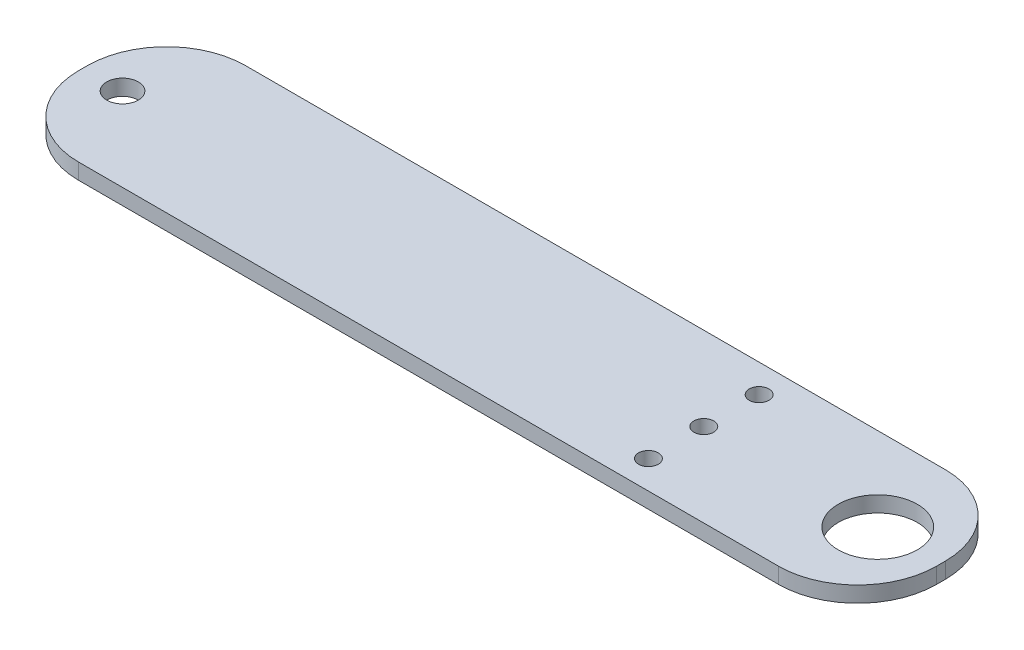
ISO-10303-21;
HEADER;
FILE_DESCRIPTION(('STEP AP214'),'2;1');
FILE_NAME('part.step','',(''),(''),'','','');
FILE_SCHEMA(('AUTOMOTIVE_DESIGN { 1 0 10303 214 1 1 1 1 }'));
ENDSEC;
DATA;
#1=APPLICATION_CONTEXT('core data for automotive mechanical design processes');
#2=APPLICATION_PROTOCOL_DEFINITION('international standard','automotive_design',2000,#1);
#3=PRODUCT_CONTEXT('',#1,'mechanical');
#4=PRODUCT('Part','Part','',(#3));
#5=PRODUCT_RELATED_PRODUCT_CATEGORY('part','',(#4));
#6=PRODUCT_DEFINITION_FORMATION('','',#4);
#7=PRODUCT_DEFINITION_CONTEXT('part definition',#1,'design');
#8=PRODUCT_DEFINITION('design','',#6,#7);
#9=PRODUCT_DEFINITION_SHAPE('','',#8);
#10=(LENGTH_UNIT() NAMED_UNIT(*) SI_UNIT(.MILLI.,.METRE.));
#11=(NAMED_UNIT(*) PLANE_ANGLE_UNIT() SI_UNIT($,.RADIAN.));
#12=(NAMED_UNIT(*) SI_UNIT($,.STERADIAN.) SOLID_ANGLE_UNIT());
#13=UNCERTAINTY_MEASURE_WITH_UNIT(LENGTH_MEASURE(1.E-05),#10,'distance_accuracy_value','');
#14=(GEOMETRIC_REPRESENTATION_CONTEXT(3) GLOBAL_UNCERTAINTY_ASSIGNED_CONTEXT((#13)) GLOBAL_UNIT_ASSIGNED_CONTEXT((#10,
#11,#12)) REPRESENTATION_CONTEXT('',''));
#15=CARTESIAN_POINT('',(0.,0.,0.));
#16=DIRECTION('',(0.,0.,1.));
#17=DIRECTION('',(1.,0.,0.));
#18=AXIS2_PLACEMENT_3D('',#15,#16,#17);
#19=CARTESIAN_POINT('',(-38.5,2.,0.));
#20=DIRECTION('',(-1.,0.,0.));
#21=DIRECTION('',(0.,0.,1.));
#22=AXIS2_PLACEMENT_3D('',#19,#20,#21);
#23=PLANE('',#22);
#24=DIRECTION('',(0.,0.,-1.));
#25=VECTOR('',#24,1.);
#26=CARTESIAN_POINT('',(-38.5,2.,0.));
#27=LINE('',#26,#25);
#28=CARTESIAN_POINT('',(-38.5,2.,0.558375634517767));
#29=VERTEX_POINT('',#28);
#30=CARTESIAN_POINT('',(-38.5,2.,-0.558375634517767));
#31=VERTEX_POINT('',#30);
#32=EDGE_CURVE('E159',#29,#31,#27,.T.);
#33=ORIENTED_EDGE('',*,*,#32,.T.);
#34=DIRECTION('',(0.,-1.,0.));
#35=VECTOR('',#34,1.);
#36=CARTESIAN_POINT('',(-38.5,2.,-0.558375634517767));
#37=LINE('',#36,#35);
#38=CARTESIAN_POINT('',(-38.5,0.,-0.558375634517767));
#39=VERTEX_POINT('',#38);
#40=EDGE_CURVE('E120',#31,#39,#37,.T.);
#41=ORIENTED_EDGE('',*,*,#40,.T.);
#42=DIRECTION('',(0.,0.,-1.));
#43=VECTOR('',#42,1.);
#44=CARTESIAN_POINT('',(-38.5,0.,0.));
#45=LINE('',#44,#43);
#46=CARTESIAN_POINT('',(-38.5,0.,0.558375634517767));
#47=VERTEX_POINT('',#46);
#48=EDGE_CURVE('E104',#47,#39,#45,.T.);
#49=ORIENTED_EDGE('',*,*,#48,.F.);
#50=DIRECTION('',(0.,-1.,0.));
#51=VECTOR('',#50,1.);
#52=CARTESIAN_POINT('',(-38.5,2.,0.558375634517767));
#53=LINE('',#52,#51);
#54=EDGE_CURVE('E117',#47,#29,#53,.F.);
#55=ORIENTED_EDGE('',*,*,#54,.T.);
#56=EDGE_LOOP('',(#33,#41,#49,#55));
#57=FACE_BOUND('',#56,.T.);
#58=ADVANCED_FACE('F35',(#57),#23,.T.);
#59=CARTESIAN_POINT('',(0.,2.,10.5583756345178));
#60=DIRECTION('',(0.,0.,-1.));
#61=DIRECTION('',(-1.,0.,0.));
#62=AXIS2_PLACEMENT_3D('',#59,#60,#61);
#63=PLANE('',#62);
#64=DIRECTION('',(1.,0.,0.));
#65=VECTOR('',#64,1.);
#66=CARTESIAN_POINT('',(0.,2.,10.5583756345178));
#67=LINE('',#66,#65);
#68=CARTESIAN_POINT('',(-28.5,2.,10.5583756345178));
#69=VERTEX_POINT('',#68);
#70=CARTESIAN_POINT('',(60.,2.,10.5583756345178));
#71=VERTEX_POINT('',#70);
#72=EDGE_CURVE('E158',#69,#71,#67,.T.);
#73=ORIENTED_EDGE('',*,*,#72,.F.);
#74=DIRECTION('',(0.,-1.,0.));
#75=VECTOR('',#74,1.);
#76=CARTESIAN_POINT('',(-28.5,0.,10.5583756345178));
#77=LINE('',#76,#75);
#78=CARTESIAN_POINT('',(-28.5,0.,10.5583756345178));
#79=VERTEX_POINT('',#78);
#80=EDGE_CURVE('E153',#69,#79,#77,.T.);
#81=ORIENTED_EDGE('',*,*,#80,.T.);
#82=DIRECTION('',(1.,0.,0.));
#83=VECTOR('',#82,1.);
#84=CARTESIAN_POINT('',(0.,0.,10.5583756345178));
#85=LINE('',#84,#83);
#86=CARTESIAN_POINT('',(60.,0.,10.5583756345178));
#87=VERTEX_POINT('',#86);
#88=EDGE_CURVE('E106',#79,#87,#85,.T.);
#89=ORIENTED_EDGE('',*,*,#88,.T.);
#90=DIRECTION('',(0.,-1.,0.));
#91=VECTOR('',#90,1.);
#92=CARTESIAN_POINT('',(60.,2.,10.5583756345178));
#93=LINE('',#92,#91);
#94=EDGE_CURVE('E151',#87,#71,#93,.F.);
#95=ORIENTED_EDGE('',*,*,#94,.T.);
#96=EDGE_LOOP('',(#73,#81,#89,#95));
#97=FACE_BOUND('',#96,.T.);
#98=ADVANCED_FACE('F156',(#97),#63,.F.);
#99=CARTESIAN_POINT('',(70.,2.,0.));
#100=DIRECTION('',(1.,0.,0.));
#101=DIRECTION('',(0.,0.,-1.));
#102=AXIS2_PLACEMENT_3D('',#99,#100,#101);
#103=PLANE('',#102);
#104=DIRECTION('',(0.,0.,1.));
#105=VECTOR('',#104,1.);
#106=CARTESIAN_POINT('',(70.,2.,0.));
#107=LINE('',#106,#105);
#108=CARTESIAN_POINT('',(70.,2.,-0.55837563451777));
#109=VERTEX_POINT('',#108);
#110=CARTESIAN_POINT('',(70.,2.,0.55837563451777));
#111=VERTEX_POINT('',#110);
#112=EDGE_CURVE('E131',#109,#111,#107,.T.);
#113=ORIENTED_EDGE('',*,*,#112,.T.);
#114=DIRECTION('',(0.,-1.,0.));
#115=VECTOR('',#114,1.);
#116=CARTESIAN_POINT('',(70.,0.,0.55837563451777));
#117=LINE('',#116,#115);
#118=CARTESIAN_POINT('',(70.,0.,0.55837563451777));
#119=VERTEX_POINT('',#118);
#120=EDGE_CURVE('E11',#111,#119,#117,.T.);
#121=ORIENTED_EDGE('',*,*,#120,.T.);
#122=DIRECTION('',(0.,0.,1.));
#123=VECTOR('',#122,1.);
#124=CARTESIAN_POINT('',(70.,0.,0.));
#125=LINE('',#124,#123);
#126=CARTESIAN_POINT('',(70.,0.,-0.55837563451777));
#127=VERTEX_POINT('',#126);
#128=EDGE_CURVE('E180',#127,#119,#125,.T.);
#129=ORIENTED_EDGE('',*,*,#128,.F.);
#130=DIRECTION('',(0.,-1.,0.));
#131=VECTOR('',#130,1.);
#132=CARTESIAN_POINT('',(70.,2.,-0.55837563451777));
#133=LINE('',#132,#131);
#134=EDGE_CURVE('E43',#127,#109,#133,.F.);
#135=ORIENTED_EDGE('',*,*,#134,.T.);
#136=EDGE_LOOP('',(#113,#121,#129,#135));
#137=FACE_BOUND('',#136,.T.);
#138=ADVANCED_FACE('F218',(#137),#103,.T.);
#139=CARTESIAN_POINT('',(62.,2.,0.));
#140=DIRECTION('',(0.,-1.,0.));
#141=DIRECTION('',(0.,0.,-1.));
#142=AXIS2_PLACEMENT_3D('',#139,#140,#141);
#143=CYLINDRICAL_SURFACE('',#142,5.);
#144=CARTESIAN_POINT('',(62.,2.,0.));
#145=DIRECTION('',(0.,1.,0.));
#146=DIRECTION('',(0.,0.,1.));
#147=AXIS2_PLACEMENT_3D('',#144,#145,#146);
#148=CIRCLE('',#147,5.);
#149=CARTESIAN_POINT('',(62.,2.,4.99999999999998));
#150=VERTEX_POINT('',#149);
#151=EDGE_CURVE('E162',#150,#150,#148,.T.);
#152=ORIENTED_EDGE('',*,*,#151,.T.);
#153=EDGE_LOOP('',(#152));
#154=FACE_BOUND('',#153,.T.);
#155=CARTESIAN_POINT('',(62.,0.,0.));
#156=DIRECTION('',(0.,1.,0.));
#157=DIRECTION('',(0.,0.,1.));
#158=AXIS2_PLACEMENT_3D('',#155,#156,#157);
#159=CIRCLE('',#158,5.);
#160=CARTESIAN_POINT('',(62.,0.,4.99999999999998));
#161=VERTEX_POINT('',#160);
#162=EDGE_CURVE('E121',#161,#161,#159,.T.);
#163=ORIENTED_EDGE('',*,*,#162,.F.);
#164=EDGE_LOOP('',(#163));
#165=FACE_BOUND('',#164,.T.);
#166=ADVANCED_FACE('F201',(#154,#165),#143,.F.);
#167=CARTESIAN_POINT('',(-33.5000000000009,2.,-1.31838984174237E-13));
#168=DIRECTION('',(0.,-1.,0.));
#169=DIRECTION('',(0.,0.,-1.));
#170=AXIS2_PLACEMENT_3D('',#167,#168,#169);
#171=CYLINDRICAL_SURFACE('',#170,2.00000000000091);
#172=CARTESIAN_POINT('',(-33.5000000000009,2.,-1.31838984174237E-13));
#173=DIRECTION('',(0.,1.,0.));
#174=DIRECTION('',(0.,0.,1.));
#175=AXIS2_PLACEMENT_3D('',#172,#173,#174);
#176=CIRCLE('',#175,2.00000000000091);
#177=CARTESIAN_POINT('',(-33.5000000000009,2.,2.00000000000078));
#178=VERTEX_POINT('',#177);
#179=EDGE_CURVE('E196',#178,#178,#176,.T.);
#180=ORIENTED_EDGE('',*,*,#179,.T.);
#181=EDGE_LOOP('',(#180));
#182=FACE_BOUND('',#181,.T.);
#183=CARTESIAN_POINT('',(-33.5000000000009,0.,-1.31838984174237E-13));
#184=DIRECTION('',(0.,1.,0.));
#185=DIRECTION('',(0.,0.,1.));
#186=AXIS2_PLACEMENT_3D('',#183,#184,#185);
#187=CIRCLE('',#186,2.00000000000091);
#188=CARTESIAN_POINT('',(-33.5000000000009,0.,2.00000000000078));
#189=VERTEX_POINT('',#188);
#190=EDGE_CURVE('E175',#189,#189,#187,.T.);
#191=ORIENTED_EDGE('',*,*,#190,.F.);
#192=EDGE_LOOP('',(#191));
#193=FACE_BOUND('',#192,.T.);
#194=ADVANCED_FACE('F238',(#182,#193),#171,.F.);
#195=CARTESIAN_POINT('',(40.,2.,0.));
#196=DIRECTION('',(0.,-1.,0.));
#197=DIRECTION('',(0.,0.,-1.));
#198=AXIS2_PLACEMENT_3D('',#195,#196,#197);
#199=CYLINDRICAL_SURFACE('',#198,1.25);
#200=CARTESIAN_POINT('',(40.,2.,0.));
#201=DIRECTION('',(0.,1.,0.));
#202=DIRECTION('',(0.,0.,1.));
#203=AXIS2_PLACEMENT_3D('',#200,#201,#202);
#204=CIRCLE('',#203,1.25);
#205=CARTESIAN_POINT('',(40.,2.,1.24999999999999));
#206=VERTEX_POINT('',#205);
#207=EDGE_CURVE('E191',#206,#206,#204,.T.);
#208=ORIENTED_EDGE('',*,*,#207,.T.);
#209=EDGE_LOOP('',(#208));
#210=FACE_BOUND('',#209,.T.);
#211=CARTESIAN_POINT('',(40.,0.,0.));
#212=DIRECTION('',(0.,1.,0.));
#213=DIRECTION('',(0.,0.,1.));
#214=AXIS2_PLACEMENT_3D('',#211,#212,#213);
#215=CIRCLE('',#214,1.25);
#216=CARTESIAN_POINT('',(40.,0.,1.24999999999999));
#217=VERTEX_POINT('',#216);
#218=EDGE_CURVE('E172',#217,#217,#215,.T.);
#219=ORIENTED_EDGE('',*,*,#218,.F.);
#220=EDGE_LOOP('',(#219));
#221=FACE_BOUND('',#220,.T.);
#222=ADVANCED_FACE('F241',(#210,#221),#199,.F.);
#223=CARTESIAN_POINT('',(40.,2.,-7.00000000000001));
#224=DIRECTION('',(0.,-1.,0.));
#225=DIRECTION('',(0.,0.,-1.));
#226=AXIS2_PLACEMENT_3D('',#223,#224,#225);
#227=CYLINDRICAL_SURFACE('',#226,1.25);
#228=CARTESIAN_POINT('',(40.,2.,-7.00000000000001));
#229=DIRECTION('',(0.,1.,0.));
#230=DIRECTION('',(0.,0.,1.));
#231=AXIS2_PLACEMENT_3D('',#228,#229,#230);
#232=CIRCLE('',#231,1.25);
#233=CARTESIAN_POINT('',(40.,2.,-5.75000000000001));
#234=VERTEX_POINT('',#233);
#235=EDGE_CURVE('E186',#234,#234,#232,.T.);
#236=ORIENTED_EDGE('',*,*,#235,.T.);
#237=EDGE_LOOP('',(#236));
#238=FACE_BOUND('',#237,.T.);
#239=CARTESIAN_POINT('',(40.,0.,-7.00000000000001));
#240=DIRECTION('',(0.,1.,0.));
#241=DIRECTION('',(0.,0.,1.));
#242=AXIS2_PLACEMENT_3D('',#239,#240,#241);
#243=CIRCLE('',#242,1.25);
#244=CARTESIAN_POINT('',(40.,0.,-5.75000000000001));
#245=VERTEX_POINT('',#244);
#246=EDGE_CURVE('E169',#245,#245,#243,.T.);
#247=ORIENTED_EDGE('',*,*,#246,.F.);
#248=EDGE_LOOP('',(#247));
#249=FACE_BOUND('',#248,.T.);
#250=ADVANCED_FACE('F245',(#238,#249),#227,.F.);
#251=CARTESIAN_POINT('',(40.,2.,6.99999999999999));
#252=DIRECTION('',(0.,-1.,0.));
#253=DIRECTION('',(0.,0.,-1.));
#254=AXIS2_PLACEMENT_3D('',#251,#252,#253);
#255=CYLINDRICAL_SURFACE('',#254,1.25);
#256=CARTESIAN_POINT('',(40.,2.,6.99999999999999));
#257=DIRECTION('',(0.,1.,0.));
#258=DIRECTION('',(0.,0.,1.));
#259=AXIS2_PLACEMENT_3D('',#256,#257,#258);
#260=CIRCLE('',#259,1.25);
#261=CARTESIAN_POINT('',(40.,2.,8.24999999999999));
#262=VERTEX_POINT('',#261);
#263=EDGE_CURVE('E183',#262,#262,#260,.T.);
#264=ORIENTED_EDGE('',*,*,#263,.T.);
#265=EDGE_LOOP('',(#264));
#266=FACE_BOUND('',#265,.T.);
#267=CARTESIAN_POINT('',(40.,0.,6.99999999999999));
#268=DIRECTION('',(0.,1.,0.));
#269=DIRECTION('',(0.,0.,1.));
#270=AXIS2_PLACEMENT_3D('',#267,#268,#269);
#271=CIRCLE('',#270,1.25);
#272=CARTESIAN_POINT('',(40.,0.,8.24999999999999));
#273=VERTEX_POINT('',#272);
#274=EDGE_CURVE('E166',#273,#273,#271,.T.);
#275=ORIENTED_EDGE('',*,*,#274,.F.);
#276=EDGE_LOOP('',(#275));
#277=FACE_BOUND('',#276,.T.);
#278=ADVANCED_FACE('F249',(#266,#277),#255,.F.);
#279=CARTESIAN_POINT('',(0.,2.,-10.5583756345178));
#280=DIRECTION('',(0.,0.,-1.));
#281=DIRECTION('',(-1.,0.,0.));
#282=AXIS2_PLACEMENT_3D('',#279,#280,#281);
#283=PLANE('',#282);
#284=DIRECTION('',(1.,0.,0.));
#285=VECTOR('',#284,1.);
#286=CARTESIAN_POINT('',(0.,0.,-10.5583756345178));
#287=LINE('',#286,#285);
#288=CARTESIAN_POINT('',(-28.5,0.,-10.5583756345178));
#289=VERTEX_POINT('',#288);
#290=CARTESIAN_POINT('',(60.,0.,-10.5583756345178));
#291=VERTEX_POINT('',#290);
#292=EDGE_CURVE('E134',#289,#291,#287,.T.);
#293=ORIENTED_EDGE('',*,*,#292,.F.);
#294=DIRECTION('',(0.,-1.,0.));
#295=VECTOR('',#294,1.);
#296=CARTESIAN_POINT('',(-28.5,2.,-10.5583756345178));
#297=LINE('',#296,#295);
#298=CARTESIAN_POINT('',(-28.5,2.,-10.5583756345178));
#299=VERTEX_POINT('',#298);
#300=EDGE_CURVE('E143',#289,#299,#297,.F.);
#301=ORIENTED_EDGE('',*,*,#300,.T.);
#302=DIRECTION('',(1.,0.,0.));
#303=VECTOR('',#302,1.);
#304=CARTESIAN_POINT('',(0.,2.,-10.5583756345178));
#305=LINE('',#304,#303);
#306=CARTESIAN_POINT('',(60.,2.,-10.5583756345178));
#307=VERTEX_POINT('',#306);
#308=EDGE_CURVE('E126',#299,#307,#305,.T.);
#309=ORIENTED_EDGE('',*,*,#308,.T.);
#310=DIRECTION('',(0.,-1.,0.));
#311=VECTOR('',#310,1.);
#312=CARTESIAN_POINT('',(60.,2.,-10.5583756345178));
#313=LINE('',#312,#311);
#314=EDGE_CURVE('E140',#307,#291,#313,.T.);
#315=ORIENTED_EDGE('',*,*,#314,.T.);
#316=EDGE_LOOP('',(#293,#301,#309,#315));
#317=FACE_BOUND('',#316,.T.);
#318=ADVANCED_FACE('F206',(#317),#283,.T.);
#319=CARTESIAN_POINT('',(0.,2.,0.));
#320=DIRECTION('',(0.,1.,0.));
#321=DIRECTION('',(0.,0.,1.));
#322=AXIS2_PLACEMENT_3D('',#319,#320,#321);
#323=PLANE('',#322);
#324=ORIENTED_EDGE('',*,*,#263,.F.);
#325=EDGE_LOOP('',(#324));
#326=FACE_BOUND('',#325,.T.);
#327=ORIENTED_EDGE('',*,*,#235,.F.);
#328=EDGE_LOOP('',(#327));
#329=FACE_BOUND('',#328,.T.);
#330=ORIENTED_EDGE('',*,*,#207,.F.);
#331=EDGE_LOOP('',(#330));
#332=FACE_BOUND('',#331,.T.);
#333=ORIENTED_EDGE('',*,*,#179,.F.);
#334=EDGE_LOOP('',(#333));
#335=FACE_BOUND('',#334,.T.);
#336=ORIENTED_EDGE('',*,*,#151,.F.);
#337=EDGE_LOOP('',(#336));
#338=FACE_BOUND('',#337,.T.);
#339=ORIENTED_EDGE('',*,*,#308,.F.);
#340=CARTESIAN_POINT('',(-28.5,2.,-0.558375634517767));
#341=DIRECTION('',(0.,1.,0.));
#342=DIRECTION('',(0.,0.,1.));
#343=AXIS2_PLACEMENT_3D('',#340,#341,#342);
#344=CIRCLE('',#343,10.);
#345=EDGE_CURVE('E149',#299,#31,#344,.T.);
#346=ORIENTED_EDGE('',*,*,#345,.T.);
#347=ORIENTED_EDGE('',*,*,#32,.F.);
#348=CARTESIAN_POINT('',(-28.5,2.,0.558375634517767));
#349=DIRECTION('',(0.,1.,0.));
#350=DIRECTION('',(0.,0.,1.));
#351=AXIS2_PLACEMENT_3D('',#348,#349,#350);
#352=CIRCLE('',#351,10.);
#353=EDGE_CURVE('E125',#29,#69,#352,.T.);
#354=ORIENTED_EDGE('',*,*,#353,.T.);
#355=ORIENTED_EDGE('',*,*,#72,.T.);
#356=CARTESIAN_POINT('',(60.,2.,0.55837563451777));
#357=DIRECTION('',(0.,1.,0.));
#358=DIRECTION('',(0.,0.,1.));
#359=AXIS2_PLACEMENT_3D('',#356,#357,#358);
#360=CIRCLE('',#359,10.);
#361=EDGE_CURVE('E50',#71,#111,#360,.T.);
#362=ORIENTED_EDGE('',*,*,#361,.T.);
#363=ORIENTED_EDGE('',*,*,#112,.F.);
#364=CARTESIAN_POINT('',(60.,2.,-0.55837563451777));
#365=DIRECTION('',(0.,1.,0.));
#366=DIRECTION('',(0.,0.,1.));
#367=AXIS2_PLACEMENT_3D('',#364,#365,#366);
#368=CIRCLE('',#367,10.);
#369=EDGE_CURVE('E145',#109,#307,#368,.T.);
#370=ORIENTED_EDGE('',*,*,#369,.T.);
#371=EDGE_LOOP('',(#339,#346,#347,#354,#355,#362,#363,#370));
#372=FACE_BOUND('',#371,.T.);
#373=ADVANCED_FACE('F204',(#326,#329,#332,#335,#338,#372),#323,.T.);
#374=CARTESIAN_POINT('',(0.,0.,0.));
#375=DIRECTION('',(0.,1.,0.));
#376=DIRECTION('',(0.,0.,1.));
#377=AXIS2_PLACEMENT_3D('',#374,#375,#376);
#378=PLANE('',#377);
#379=ORIENTED_EDGE('',*,*,#274,.T.);
#380=EDGE_LOOP('',(#379));
#381=FACE_BOUND('',#380,.T.);
#382=ORIENTED_EDGE('',*,*,#246,.T.);
#383=EDGE_LOOP('',(#382));
#384=FACE_BOUND('',#383,.T.);
#385=ORIENTED_EDGE('',*,*,#218,.T.);
#386=EDGE_LOOP('',(#385));
#387=FACE_BOUND('',#386,.T.);
#388=ORIENTED_EDGE('',*,*,#190,.T.);
#389=EDGE_LOOP('',(#388));
#390=FACE_BOUND('',#389,.T.);
#391=ORIENTED_EDGE('',*,*,#162,.T.);
#392=EDGE_LOOP('',(#391));
#393=FACE_BOUND('',#392,.T.);
#394=ORIENTED_EDGE('',*,*,#48,.T.);
#395=CARTESIAN_POINT('',(-28.5,0.,-0.558375634517767));
#396=DIRECTION('',(0.,1.,0.));
#397=DIRECTION('',(0.,0.,1.));
#398=AXIS2_PLACEMENT_3D('',#395,#396,#397);
#399=CIRCLE('',#398,10.);
#400=EDGE_CURVE('E111',#39,#289,#399,.F.);
#401=ORIENTED_EDGE('',*,*,#400,.T.);
#402=ORIENTED_EDGE('',*,*,#292,.T.);
#403=CARTESIAN_POINT('',(60.,0.,-0.55837563451777));
#404=DIRECTION('',(0.,1.,0.));
#405=DIRECTION('',(0.,0.,1.));
#406=AXIS2_PLACEMENT_3D('',#403,#404,#405);
#407=CIRCLE('',#406,10.);
#408=EDGE_CURVE('E128',#291,#127,#407,.F.);
#409=ORIENTED_EDGE('',*,*,#408,.T.);
#410=ORIENTED_EDGE('',*,*,#128,.T.);
#411=CARTESIAN_POINT('',(60.,0.,0.55837563451777));
#412=DIRECTION('',(0.,1.,0.));
#413=DIRECTION('',(0.,0.,1.));
#414=AXIS2_PLACEMENT_3D('',#411,#412,#413);
#415=CIRCLE('',#414,10.);
#416=EDGE_CURVE('E112',#119,#87,#415,.F.);
#417=ORIENTED_EDGE('',*,*,#416,.T.);
#418=ORIENTED_EDGE('',*,*,#88,.F.);
#419=CARTESIAN_POINT('',(-28.5,0.,0.558375634517767));
#420=DIRECTION('',(0.,1.,0.));
#421=DIRECTION('',(0.,0.,1.));
#422=AXIS2_PLACEMENT_3D('',#419,#420,#421);
#423=CIRCLE('',#422,10.);
#424=EDGE_CURVE('E101',#79,#47,#423,.F.);
#425=ORIENTED_EDGE('',*,*,#424,.T.);
#426=EDGE_LOOP('',(#394,#401,#402,#409,#410,#417,#418,#425));
#427=FACE_BOUND('',#426,.T.);
#428=ADVANCED_FACE('F103',(#381,#384,#387,#390,#393,#427),#378,.F.);
#429=CARTESIAN_POINT('',(-28.5,2.,-0.558375634517767));
#430=DIRECTION('',(0.,-1.,0.));
#431=DIRECTION('',(0.,0.,-1.));
#432=AXIS2_PLACEMENT_3D('',#429,#430,#431);
#433=CYLINDRICAL_SURFACE('',#432,10.);
#434=ORIENTED_EDGE('',*,*,#345,.F.);
#435=ORIENTED_EDGE('',*,*,#300,.F.);
#436=ORIENTED_EDGE('',*,*,#400,.F.);
#437=ORIENTED_EDGE('',*,*,#40,.F.);
#438=EDGE_LOOP('',(#434,#435,#436,#437));
#439=FACE_BOUND('',#438,.T.);
#440=ADVANCED_FACE('F216',(#439),#433,.T.);
#441=CARTESIAN_POINT('',(-28.5,2.,0.558375634517767));
#442=DIRECTION('',(0.,1.,0.));
#443=DIRECTION('',(0.,0.,1.));
#444=AXIS2_PLACEMENT_3D('',#441,#442,#443);
#445=CYLINDRICAL_SURFACE('',#444,10.);
#446=ORIENTED_EDGE('',*,*,#353,.F.);
#447=ORIENTED_EDGE('',*,*,#54,.F.);
#448=ORIENTED_EDGE('',*,*,#424,.F.);
#449=ORIENTED_EDGE('',*,*,#80,.F.);
#450=EDGE_LOOP('',(#446,#447,#448,#449));
#451=FACE_BOUND('',#450,.T.);
#452=ADVANCED_FACE('F124',(#451),#445,.T.);
#453=CARTESIAN_POINT('',(60.,2.,0.55837563451777));
#454=DIRECTION('',(0.,1.,0.));
#455=DIRECTION('',(0.,0.,1.));
#456=AXIS2_PLACEMENT_3D('',#453,#454,#455);
#457=CYLINDRICAL_SURFACE('',#456,10.);
#458=ORIENTED_EDGE('',*,*,#361,.F.);
#459=ORIENTED_EDGE('',*,*,#94,.F.);
#460=ORIENTED_EDGE('',*,*,#416,.F.);
#461=ORIENTED_EDGE('',*,*,#120,.F.);
#462=EDGE_LOOP('',(#458,#459,#460,#461));
#463=FACE_BOUND('',#462,.T.);
#464=ADVANCED_FACE('F221',(#463),#457,.T.);
#465=CARTESIAN_POINT('',(60.,2.,-0.55837563451777));
#466=DIRECTION('',(0.,-1.,0.));
#467=DIRECTION('',(0.,0.,-1.));
#468=AXIS2_PLACEMENT_3D('',#465,#466,#467);
#469=CYLINDRICAL_SURFACE('',#468,10.);
#470=ORIENTED_EDGE('',*,*,#369,.F.);
#471=ORIENTED_EDGE('',*,*,#134,.F.);
#472=ORIENTED_EDGE('',*,*,#408,.F.);
#473=ORIENTED_EDGE('',*,*,#314,.F.);
#474=EDGE_LOOP('',(#470,#471,#472,#473));
#475=FACE_BOUND('',#474,.T.);
#476=ADVANCED_FACE('F37',(#475),#469,.T.);
#477=CLOSED_SHELL('',(#58,#98,#138,#166,#194,#222,#250,#278,#318,#373,#428,#440,#452,#464,#476));
#478=MANIFOLD_SOLID_BREP('B2',#477);
#479=ADVANCED_BREP_SHAPE_REPRESENTATION('',(#18,#478),#14);
#480=SHAPE_DEFINITION_REPRESENTATION(#9,#479);
ENDSEC;
END-ISO-10303-21;
